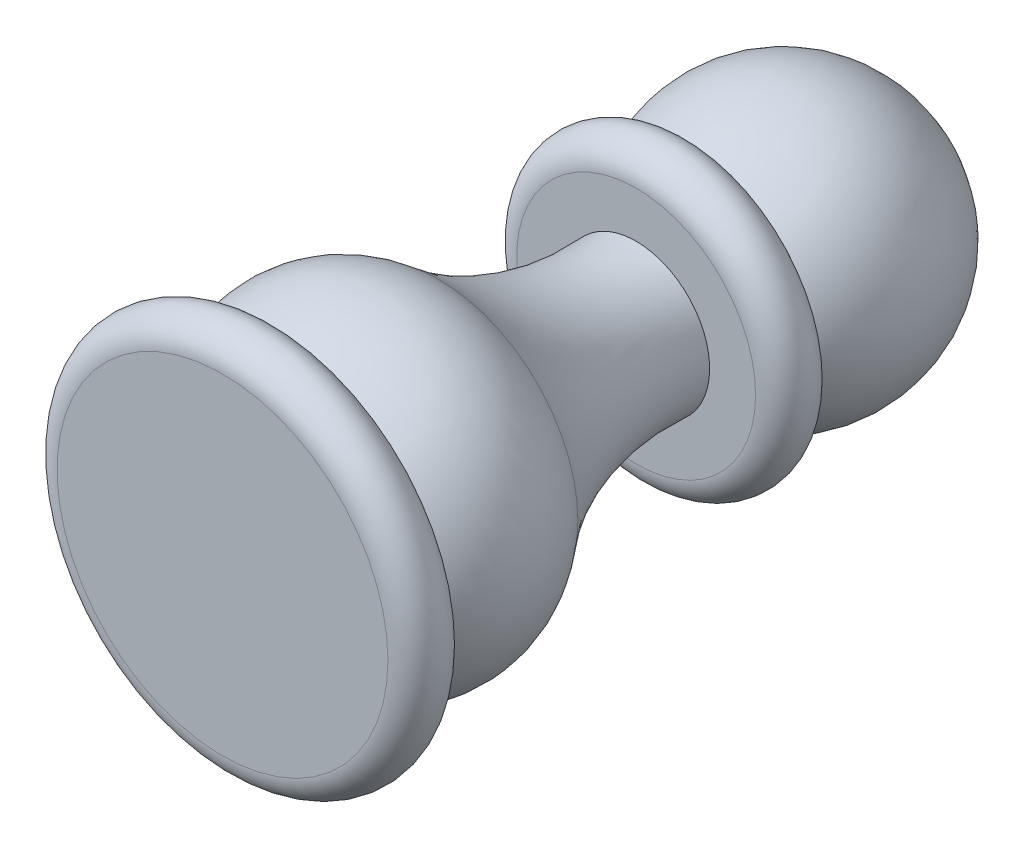
ISO-10303-21;
HEADER;
FILE_DESCRIPTION(('STEP AP214'),'2;1');
FILE_NAME('part.step','',(''),(''),'','','');
FILE_SCHEMA(('AUTOMOTIVE_DESIGN { 1 0 10303 214 1 1 1 1 }'));
ENDSEC;
DATA;
#1=APPLICATION_CONTEXT('core data for automotive mechanical design processes');
#2=APPLICATION_PROTOCOL_DEFINITION('international standard','automotive_design',2000,#1);
#3=PRODUCT_CONTEXT('',#1,'mechanical');
#4=PRODUCT('Part','Part','',(#3));
#5=PRODUCT_RELATED_PRODUCT_CATEGORY('part','',(#4));
#6=PRODUCT_DEFINITION_FORMATION('','',#4);
#7=PRODUCT_DEFINITION_CONTEXT('part definition',#1,'design');
#8=PRODUCT_DEFINITION('design','',#6,#7);
#9=PRODUCT_DEFINITION_SHAPE('','',#8);
#10=(LENGTH_UNIT() NAMED_UNIT(*) SI_UNIT(.MILLI.,.METRE.));
#11=(NAMED_UNIT(*) PLANE_ANGLE_UNIT() SI_UNIT($,.RADIAN.));
#12=(NAMED_UNIT(*) SI_UNIT($,.STERADIAN.) SOLID_ANGLE_UNIT());
#13=UNCERTAINTY_MEASURE_WITH_UNIT(LENGTH_MEASURE(1.E-05),#10,'distance_accuracy_value','');
#14=(GEOMETRIC_REPRESENTATION_CONTEXT(3) GLOBAL_UNCERTAINTY_ASSIGNED_CONTEXT((#13)) GLOBAL_UNIT_ASSIGNED_CONTEXT((#10,
#11,#12)) REPRESENTATION_CONTEXT('',''));
#15=CARTESIAN_POINT('',(0.,0.,0.));
#16=DIRECTION('',(0.,0.,1.));
#17=DIRECTION('',(1.,0.,0.));
#18=AXIS2_PLACEMENT_3D('',#15,#16,#17);
#19=CARTESIAN_POINT('',(0.,0.,-20.0130142505848));
#20=DIRECTION('',(0.,0.,1.));
#21=DIRECTION('',(1.,0.,0.));
#22=AXIS2_PLACEMENT_3D('',#19,#20,#21);
#23=TOROIDAL_SURFACE('',#22,18.9674934150796,15.);
#24=CARTESIAN_POINT('',(0.,0.,-21.));
#25=DIRECTION('',(0.,0.,1.));
#26=DIRECTION('',(1.,0.,0.));
#27=AXIS2_PLACEMENT_3D('',#24,#25,#26);
#28=CIRCLE('',#27,4.);
#29=CARTESIAN_POINT('',(4.,0.,-21.));
#30=VERTEX_POINT('',#29);
#31=EDGE_CURVE('E120',#30,#30,#28,.T.);
#32=ORIENTED_EDGE('',*,*,#31,.T.);
#33=EDGE_LOOP('',(#32));
#34=FACE_BOUND('',#33,.T.);
#35=CARTESIAN_POINT('',(0.,0.,-10.2704306233132));
#36=DIRECTION('',(0.,0.,1.));
#37=DIRECTION('',(1.,0.,0.));
#38=AXIS2_PLACEMENT_3D('',#35,#36,#37);
#39=CIRCLE('',#38,7.56214097573703);
#40=CARTESIAN_POINT('',(7.56214097573703,0.,-10.2704306233132));
#41=VERTEX_POINT('',#40);
#42=EDGE_CURVE('E11',#41,#41,#39,.T.);
#43=ORIENTED_EDGE('',*,*,#42,.F.);
#44=EDGE_LOOP('',(#43));
#45=FACE_BOUND('',#44,.T.);
#46=ADVANCED_FACE('F44',(#34,#45),#23,.F.);
#47=CARTESIAN_POINT('',(0.,0.,-6.37339717240448));
#48=DIRECTION('',(0.,0.,1.));
#49=DIRECTION('',(1.,0.,0.));
#50=AXIS2_PLACEMENT_3D('',#47,#48,#49);
#51=DEGENERATE_TOROIDAL_SURFACE('',#50,3.,6.,.T.);
#52=CARTESIAN_POINT('',(0.,0.,-1.5));
#53=DIRECTION('',(0.,0.,1.));
#54=DIRECTION('',(1.,0.,0.));
#55=AXIS2_PLACEMENT_3D('',#52,#53,#54);
#56=CIRCLE('',#55,6.5);
#57=CARTESIAN_POINT('',(6.5,0.,-1.5));
#58=VERTEX_POINT('',#57);
#59=EDGE_CURVE('E52',#58,#58,#56,.T.);
#60=ORIENTED_EDGE('',*,*,#59,.F.);
#61=EDGE_LOOP('',(#60));
#62=FACE_BOUND('',#61,.T.);
#63=ORIENTED_EDGE('',*,*,#42,.T.);
#64=EDGE_LOOP('',(#63));
#65=FACE_BOUND('',#64,.T.);
#66=ADVANCED_FACE('F81',(#62,#65),#51,.T.);
#67=CARTESIAN_POINT('',(0.,0.,-1.5));
#68=DIRECTION('',(0.,0.,-1.));
#69=DIRECTION('',(-1.,0.,0.));
#70=AXIS2_PLACEMENT_3D('',#67,#68,#69);
#71=PLANE('',#70);
#72=ORIENTED_EDGE('',*,*,#59,.T.);
#73=EDGE_LOOP('',(#72));
#74=FACE_BOUND('',#73,.T.);
#75=CARTESIAN_POINT('',(0.,0.,-1.5));
#76=DIRECTION('',(0.,0.,1.));
#77=DIRECTION('',(1.,0.,0.));
#78=AXIS2_PLACEMENT_3D('',#75,#76,#77);
#79=CIRCLE('',#78,9.);
#80=CARTESIAN_POINT('',(9.,0.,-1.5));
#81=VERTEX_POINT('',#80);
#82=EDGE_CURVE('E95',#81,#81,#79,.T.);
#83=ORIENTED_EDGE('',*,*,#82,.F.);
#84=EDGE_LOOP('',(#83));
#85=FACE_BOUND('',#84,.T.);
#86=ADVANCED_FACE('F78',(#74,#85),#71,.T.);
#87=CARTESIAN_POINT('',(0.,0.,0.));
#88=DIRECTION('',(0.,0.,1.));
#89=DIRECTION('',(1.,0.,0.));
#90=AXIS2_PLACEMENT_3D('',#87,#88,#89);
#91=TOROIDAL_SURFACE('',#90,9.,1.5);
#92=CARTESIAN_POINT('',(0.,0.,1.5));
#93=DIRECTION('',(0.,0.,1.));
#94=DIRECTION('',(1.,0.,0.));
#95=AXIS2_PLACEMENT_3D('',#92,#93,#94);
#96=CIRCLE('',#95,9.);
#97=CARTESIAN_POINT('',(9.,0.,1.5));
#98=VERTEX_POINT('',#97);
#99=EDGE_CURVE('E98',#98,#98,#96,.T.);
#100=ORIENTED_EDGE('',*,*,#99,.F.);
#101=EDGE_LOOP('',(#100));
#102=FACE_BOUND('',#101,.T.);
#103=ORIENTED_EDGE('',*,*,#82,.T.);
#104=EDGE_LOOP('',(#103));
#105=FACE_BOUND('',#104,.T.);
#106=ADVANCED_FACE('F74',(#102,#105),#91,.T.);
#107=CARTESIAN_POINT('',(0.,0.,1.5));
#108=DIRECTION('',(0.,0.,-1.));
#109=DIRECTION('',(-1.,0.,0.));
#110=AXIS2_PLACEMENT_3D('',#107,#108,#109);
#111=PLANE('',#110);
#112=ORIENTED_EDGE('',*,*,#99,.T.);
#113=EDGE_LOOP('',(#112));
#114=FACE_BOUND('',#113,.T.);
#115=ADVANCED_FACE('F70',(#114),#111,.F.);
#116=CARTESIAN_POINT('',(0.,0.,-29.));
#117=DIRECTION('',(0.,0.,1.));
#118=DIRECTION('',(1.,0.,0.));
#119=AXIS2_PLACEMENT_3D('',#116,#117,#118);
#120=SPHERICAL_SURFACE('',#119,7.5);
#121=CARTESIAN_POINT('',(0.,0.,-24.));
#122=DIRECTION('',(0.,0.,1.));
#123=DIRECTION('',(1.,0.,0.));
#124=AXIS2_PLACEMENT_3D('',#121,#122,#123);
#125=CIRCLE('',#124,5.59016994374948);
#126=CARTESIAN_POINT('',(5.59016994374948,0.,-24.));
#127=VERTEX_POINT('',#126);
#128=EDGE_CURVE('E108',#127,#127,#125,.T.);
#129=ORIENTED_EDGE('',*,*,#128,.F.);
#130=EDGE_LOOP('',(#129));
#131=FACE_BOUND('',#130,.T.);
#132=ADVANCED_FACE('F73',(#131),#120,.T.);
#133=CARTESIAN_POINT('',(0.,0.,-24.));
#134=DIRECTION('',(0.,0.,-1.));
#135=DIRECTION('',(-1.,0.,0.));
#136=AXIS2_PLACEMENT_3D('',#133,#134,#135);
#137=PLANE('',#136);
#138=ORIENTED_EDGE('',*,*,#128,.T.);
#139=EDGE_LOOP('',(#138));
#140=FACE_BOUND('',#139,.T.);
#141=CARTESIAN_POINT('',(0.,0.,-24.));
#142=DIRECTION('',(0.,0.,1.));
#143=DIRECTION('',(1.,0.,0.));
#144=AXIS2_PLACEMENT_3D('',#141,#142,#143);
#145=CIRCLE('',#144,6.5);
#146=CARTESIAN_POINT('',(6.5,0.,-24.));
#147=VERTEX_POINT('',#146);
#148=EDGE_CURVE('E112',#147,#147,#145,.T.);
#149=ORIENTED_EDGE('',*,*,#148,.F.);
#150=EDGE_LOOP('',(#149));
#151=FACE_BOUND('',#150,.T.);
#152=ADVANCED_FACE('F133',(#140,#151),#137,.T.);
#153=CARTESIAN_POINT('',(0.,0.,-22.5));
#154=DIRECTION('',(0.,0.,1.));
#155=DIRECTION('',(1.,0.,0.));
#156=AXIS2_PLACEMENT_3D('',#153,#154,#155);
#157=TOROIDAL_SURFACE('',#156,6.5,1.5);
#158=CARTESIAN_POINT('',(0.,0.,-21.));
#159=DIRECTION('',(0.,0.,1.));
#160=DIRECTION('',(1.,0.,0.));
#161=AXIS2_PLACEMENT_3D('',#158,#159,#160);
#162=CIRCLE('',#161,6.5);
#163=CARTESIAN_POINT('',(6.5,0.,-21.));
#164=VERTEX_POINT('',#163);
#165=EDGE_CURVE('E116',#164,#164,#162,.T.);
#166=ORIENTED_EDGE('',*,*,#165,.F.);
#167=EDGE_LOOP('',(#166));
#168=FACE_BOUND('',#167,.T.);
#169=ORIENTED_EDGE('',*,*,#148,.T.);
#170=EDGE_LOOP('',(#169));
#171=FACE_BOUND('',#170,.T.);
#172=ADVANCED_FACE('F127',(#168,#171),#157,.T.);
#173=CARTESIAN_POINT('',(0.,0.,-21.));
#174=DIRECTION('',(0.,0.,-1.));
#175=DIRECTION('',(-1.,0.,0.));
#176=AXIS2_PLACEMENT_3D('',#173,#174,#175);
#177=PLANE('',#176);
#178=ORIENTED_EDGE('',*,*,#31,.F.);
#179=EDGE_LOOP('',(#178));
#180=FACE_BOUND('',#179,.T.);
#181=ORIENTED_EDGE('',*,*,#165,.T.);
#182=EDGE_LOOP('',(#181));
#183=FACE_BOUND('',#182,.T.);
#184=ADVANCED_FACE('F125',(#180,#183),#177,.F.);
#185=CLOSED_SHELL('',(#46,#66,#86,#106,#115,#132,#152,#172,#184));
#186=CARTESIAN_POINT('',(-3.,0.,-6.37339717240448));
#187=DIRECTION('',(0.,-1.,0.));
#188=DIRECTION('',(1.,0.,0.));
#189=AXIS2_PLACEMENT_3D('',#186,#187,#188);
#190=CIRCLE('',#189,6.);
#191=TRIMMED_CURVE('',#190,(PARAMETER_VALUE(-1.0471975511966)),
(PARAMETER_VALUE(1.0471975511966)),.T.,.PARAMETER.);
#192=CARTESIAN_POINT('',(0.,0.,-6.37339717240448));
#193=DIRECTION('',(0.,0.,1.));
#194=AXIS1_PLACEMENT('',#192,#193);
#195=SURFACE_OF_REVOLUTION('',#191,#194);
#196=CARTESIAN_POINT('',(0.,0.,-1.5));
#197=DIRECTION('',(0.,0.,1.));
#198=DIRECTION('',(1.,0.,0.));
#199=AXIS2_PLACEMENT_3D('',#196,#197,#198);
#200=CIRCLE('',#199,0.500000000000008);
#201=CARTESIAN_POINT('',(0.500000000000008,0.,-1.5));
#202=VERTEX_POINT('',#201);
#203=EDGE_CURVE('E104',#202,#202,#200,.T.);
#204=ORIENTED_EDGE('',*,*,#203,.F.);
#205=EDGE_LOOP('',(#204));
#206=FACE_BOUND('',#205,.T.);
#207=CARTESIAN_POINT('',(0.,0.,-1.17724474969785));
#208=VERTEX_POINT('',#207);
#209=VERTEX_LOOP('',#208);
#210=FACE_BOUND('',#209,.T.);
#211=ADVANCED_FACE('F55',(#206,#210),#195,.F.);
#212=CARTESIAN_POINT('',(0.,0.,-1.5));
#213=DIRECTION('',(0.,0.,-1.));
#214=DIRECTION('',(-1.,0.,0.));
#215=AXIS2_PLACEMENT_3D('',#212,#213,#214);
#216=PLANE('',#215);
#217=ORIENTED_EDGE('',*,*,#203,.T.);
#218=EDGE_LOOP('',(#217));
#219=FACE_BOUND('',#218,.T.);
#220=ADVANCED_FACE('F57',(#219),#216,.F.);
#221=CLOSED_SHELL('',(#211,#220));
#222=ORIENTED_CLOSED_SHELL('',*,#221,.T.);
#223=BREP_WITH_VOIDS('B2',#185,(#222));
#224=ADVANCED_BREP_SHAPE_REPRESENTATION('',(#18,#223),#14);
#225=SHAPE_DEFINITION_REPRESENTATION(#9,#224);
ENDSEC;
END-ISO-10303-21;
